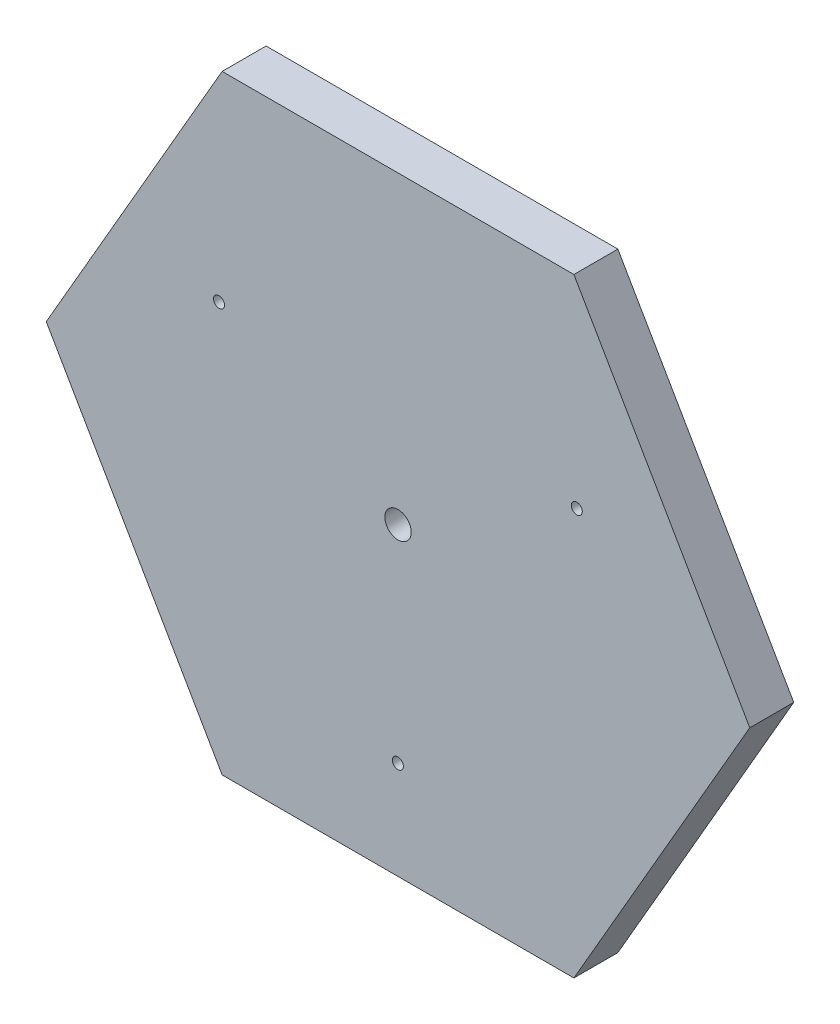
ISO-10303-21;
HEADER;
FILE_DESCRIPTION(('STEP AP214'),'2;1');
FILE_NAME('part.step','',(''),(''),'','','');
FILE_SCHEMA(('AUTOMOTIVE_DESIGN { 1 0 10303 214 1 1 1 1 }'));
ENDSEC;
DATA;
#1=APPLICATION_CONTEXT('core data for automotive mechanical design processes');
#2=APPLICATION_PROTOCOL_DEFINITION('international standard','automotive_design',2000,#1);
#3=PRODUCT_CONTEXT('',#1,'mechanical');
#4=PRODUCT('Part','Part','',(#3));
#5=PRODUCT_RELATED_PRODUCT_CATEGORY('part','',(#4));
#6=PRODUCT_DEFINITION_FORMATION('','',#4);
#7=PRODUCT_DEFINITION_CONTEXT('part definition',#1,'design');
#8=PRODUCT_DEFINITION('design','',#6,#7);
#9=PRODUCT_DEFINITION_SHAPE('','',#8);
#10=(LENGTH_UNIT() NAMED_UNIT(*) SI_UNIT(.MILLI.,.METRE.));
#11=(NAMED_UNIT(*) PLANE_ANGLE_UNIT() SI_UNIT($,.RADIAN.));
#12=(NAMED_UNIT(*) SI_UNIT($,.STERADIAN.) SOLID_ANGLE_UNIT());
#13=UNCERTAINTY_MEASURE_WITH_UNIT(LENGTH_MEASURE(1.E-05),#10,'distance_accuracy_value','');
#14=(GEOMETRIC_REPRESENTATION_CONTEXT(3) GLOBAL_UNCERTAINTY_ASSIGNED_CONTEXT((#13)) GLOBAL_UNIT_ASSIGNED_CONTEXT((#10,
#11,#12)) REPRESENTATION_CONTEXT('',''));
#15=CARTESIAN_POINT('',(0.,0.,0.));
#16=DIRECTION('',(0.,0.,1.));
#17=DIRECTION('',(1.,0.,0.));
#18=AXIS2_PLACEMENT_3D('',#15,#16,#17);
#19=CARTESIAN_POINT('',(0.,0.,10.));
#20=DIRECTION('',(0.,0.,1.));
#21=DIRECTION('',(1.,0.,0.));
#22=AXIS2_PLACEMENT_3D('',#19,#20,#21);
#23=PLANE('',#22);
#24=CARTESIAN_POINT('',(105.194995266538,79.7661246229569,10.));
#25=DIRECTION('',(0.,0.,1.));
#26=DIRECTION('',(1.,0.,0.));
#27=AXIS2_PLACEMENT_3D('',#24,#25,#26);
#28=CIRCLE('',#27,1.25);
#29=CARTESIAN_POINT('',(106.444995266538,79.7661246229569,10.));
#30=VERTEX_POINT('',#29);
#31=EDGE_CURVE('E189',#30,#30,#28,.T.);
#32=ORIENTED_EDGE('',*,*,#31,.F.);
#33=EDGE_LOOP('',(#32));
#34=FACE_BOUND('',#33,.T.);
#35=CARTESIAN_POINT('',(23.8297565584667,79.759786639688,10.));
#36=DIRECTION('',(0.,0.,1.));
#37=DIRECTION('',(1.,0.,0.));
#38=AXIS2_PLACEMENT_3D('',#35,#36,#37);
#39=CIRCLE('',#38,1.25);
#40=CARTESIAN_POINT('',(25.0797565584667,79.759786639688,10.));
#41=VERTEX_POINT('',#40);
#42=EDGE_CURVE('E122',#41,#41,#39,.T.);
#43=ORIENTED_EDGE('',*,*,#42,.F.);
#44=EDGE_LOOP('',(#43));
#45=FACE_BOUND('',#44,.T.);
#46=DIRECTION('',(-1.,0.,0.));
#47=VECTOR('',#46,1.);
#48=CARTESIAN_POINT('',(104.538271299393,125.536397109811,10.));
#49=LINE('',#48,#47);
#50=CARTESIAN_POINT('',(104.538271299393,125.536397109811,10.));
#51=VERTEX_POINT('',#50);
#52=CARTESIAN_POINT('',(24.5382712993934,125.536397109812,10.));
#53=VERTEX_POINT('',#52);
#54=EDGE_CURVE('E129',#51,#53,#49,.T.);
#55=ORIENTED_EDGE('',*,*,#54,.T.);
#56=DIRECTION('',(-0.500000000000001,-0.866025403784438,0.));
#57=VECTOR('',#56,1.);
#58=CARTESIAN_POINT('',(24.5382712993934,125.536397109812,10.));
#59=LINE('',#58,#57);
#60=CARTESIAN_POINT('',(-15.4617287006068,56.2543648070565,10.));
#61=VERTEX_POINT('',#60);
#62=EDGE_CURVE('E87',#53,#61,#59,.T.);
#63=ORIENTED_EDGE('',*,*,#62,.T.);
#64=DIRECTION('',(0.499999999999999,-0.866025403784439,0.));
#65=VECTOR('',#64,1.);
#66=CARTESIAN_POINT('',(-15.4617287006068,56.2543648070565,10.));
#67=LINE('',#66,#65);
#68=CARTESIAN_POINT('',(24.5382712993931,-13.0276674956986,10.));
#69=VERTEX_POINT('',#68);
#70=EDGE_CURVE('E100',#61,#69,#67,.T.);
#71=ORIENTED_EDGE('',*,*,#70,.T.);
#72=DIRECTION('',(1.,0.,0.));
#73=VECTOR('',#72,1.);
#74=CARTESIAN_POINT('',(24.5382712993931,-13.0276674956986,10.));
#75=LINE('',#74,#73);
#76=CARTESIAN_POINT('',(104.538271299393,-13.0276674956987,10.));
#77=VERTEX_POINT('',#76);
#78=EDGE_CURVE('E94',#69,#77,#75,.T.);
#79=ORIENTED_EDGE('',*,*,#78,.T.);
#80=DIRECTION('',(0.500000000000001,0.866025403784438,0.));
#81=VECTOR('',#80,1.);
#82=CARTESIAN_POINT('',(104.538271299393,-13.0276674956987,10.));
#83=LINE('',#82,#81);
#84=CARTESIAN_POINT('',(144.538271299393,56.2543648070564,10.));
#85=VERTEX_POINT('',#84);
#86=EDGE_CURVE('E98',#77,#85,#83,.T.);
#87=ORIENTED_EDGE('',*,*,#86,.T.);
#88=DIRECTION('',(-0.499999999999999,0.866025403784439,0.));
#89=VECTOR('',#88,1.);
#90=CARTESIAN_POINT('',(144.538271299393,56.2543648070564,10.));
#91=LINE('',#90,#89);
#92=EDGE_CURVE('E50',#85,#51,#91,.T.);
#93=ORIENTED_EDGE('',*,*,#92,.T.);
#94=EDGE_LOOP('',(#55,#63,#71,#79,#87,#93));
#95=FACE_BOUND('',#94,.T.);
#96=CARTESIAN_POINT('',(64.5,9.25443622821498,10.));
#97=DIRECTION('',(0.,0.,1.));
#98=DIRECTION('',(1.,0.,0.));
#99=AXIS2_PLACEMENT_3D('',#96,#97,#98);
#100=CIRCLE('',#99,1.25);
#101=CARTESIAN_POINT('',(65.75,9.25443622821498,10.));
#102=VERTEX_POINT('',#101);
#103=EDGE_CURVE('E195',#102,#102,#100,.T.);
#104=ORIENTED_EDGE('',*,*,#103,.F.);
#105=EDGE_LOOP('',(#104));
#106=FACE_BOUND('',#105,.T.);
#107=CARTESIAN_POINT('',(64.5382712993932,56.2543648070565,10.));
#108=DIRECTION('',(0.,0.,1.));
#109=DIRECTION('',(1.,0.,0.));
#110=AXIS2_PLACEMENT_3D('',#107,#108,#109);
#111=CIRCLE('',#110,3.);
#112=CARTESIAN_POINT('',(67.5382712993932,56.2543648070565,10.));
#113=VERTEX_POINT('',#112);
#114=EDGE_CURVE('E180',#113,#113,#111,.T.);
#115=ORIENTED_EDGE('',*,*,#114,.F.);
#116=EDGE_LOOP('',(#115));
#117=FACE_BOUND('',#116,.T.);
#118=ADVANCED_FACE('F33',(#34,#45,#95,#106,#117),#23,.T.);
#119=CARTESIAN_POINT('',(0.,0.,0.));
#120=DIRECTION('',(0.,0.,1.));
#121=DIRECTION('',(1.,0.,0.));
#122=AXIS2_PLACEMENT_3D('',#119,#120,#121);
#123=PLANE('',#122);
#124=DIRECTION('',(-1.,0.,0.));
#125=VECTOR('',#124,1.);
#126=CARTESIAN_POINT('',(104.538271299393,125.536397109811,0.));
#127=LINE('',#126,#125);
#128=CARTESIAN_POINT('',(104.538271299393,125.536397109811,0.));
#129=VERTEX_POINT('',#128);
#130=CARTESIAN_POINT('',(24.5382712993934,125.536397109812,0.));
#131=VERTEX_POINT('',#130);
#132=EDGE_CURVE('E118',#129,#131,#127,.T.);
#133=ORIENTED_EDGE('',*,*,#132,.F.);
#134=DIRECTION('',(-0.499999999999999,0.866025403784439,0.));
#135=VECTOR('',#134,1.);
#136=CARTESIAN_POINT('',(144.538271299393,56.2543648070564,0.));
#137=LINE('',#136,#135);
#138=CARTESIAN_POINT('',(144.538271299393,56.2543648070564,0.));
#139=VERTEX_POINT('',#138);
#140=EDGE_CURVE('E79',#139,#129,#137,.T.);
#141=ORIENTED_EDGE('',*,*,#140,.F.);
#142=DIRECTION('',(0.500000000000001,0.866025403784438,0.));
#143=VECTOR('',#142,1.);
#144=CARTESIAN_POINT('',(104.538271299393,-13.0276674956987,0.));
#145=LINE('',#144,#143);
#146=CARTESIAN_POINT('',(104.538271299393,-13.0276674956987,0.));
#147=VERTEX_POINT('',#146);
#148=EDGE_CURVE('E73',#147,#139,#145,.T.);
#149=ORIENTED_EDGE('',*,*,#148,.F.);
#150=DIRECTION('',(1.,0.,0.));
#151=VECTOR('',#150,1.);
#152=CARTESIAN_POINT('',(24.5382712993931,-13.0276674956986,0.));
#153=LINE('',#152,#151);
#154=CARTESIAN_POINT('',(24.5382712993931,-13.0276674956986,0.));
#155=VERTEX_POINT('',#154);
#156=EDGE_CURVE('E108',#155,#147,#153,.T.);
#157=ORIENTED_EDGE('',*,*,#156,.F.);
#158=DIRECTION('',(0.499999999999999,-0.866025403784439,0.));
#159=VECTOR('',#158,1.);
#160=CARTESIAN_POINT('',(-15.4617287006068,56.2543648070565,0.));
#161=LINE('',#160,#159);
#162=CARTESIAN_POINT('',(-15.4617287006068,56.2543648070565,0.));
#163=VERTEX_POINT('',#162);
#164=EDGE_CURVE('E124',#163,#155,#161,.T.);
#165=ORIENTED_EDGE('',*,*,#164,.F.);
#166=DIRECTION('',(-0.500000000000001,-0.866025403784438,0.));
#167=VECTOR('',#166,1.);
#168=CARTESIAN_POINT('',(24.5382712993934,125.536397109812,0.));
#169=LINE('',#168,#167);
#170=EDGE_CURVE('E121',#131,#163,#169,.T.);
#171=ORIENTED_EDGE('',*,*,#170,.F.);
#172=EDGE_LOOP('',(#133,#141,#149,#157,#165,#171));
#173=FACE_BOUND('',#172,.T.);
#174=CARTESIAN_POINT('',(23.8297565584667,79.759786639688,0.));
#175=DIRECTION('',(0.,0.,1.));
#176=DIRECTION('',(1.,0.,0.));
#177=AXIS2_PLACEMENT_3D('',#174,#175,#176);
#178=CIRCLE('',#177,1.25);
#179=CARTESIAN_POINT('',(25.0797565584667,79.759786639688,0.));
#180=VERTEX_POINT('',#179);
#181=EDGE_CURVE('E198',#180,#180,#178,.T.);
#182=ORIENTED_EDGE('',*,*,#181,.T.);
#183=EDGE_LOOP('',(#182));
#184=FACE_BOUND('',#183,.T.);
#185=CARTESIAN_POINT('',(64.5,9.25443622821498,0.));
#186=DIRECTION('',(0.,0.,1.));
#187=DIRECTION('',(1.,0.,0.));
#188=AXIS2_PLACEMENT_3D('',#185,#186,#187);
#189=CIRCLE('',#188,1.25);
#190=CARTESIAN_POINT('',(65.75,9.25443622821498,0.));
#191=VERTEX_POINT('',#190);
#192=EDGE_CURVE('E192',#191,#191,#189,.T.);
#193=ORIENTED_EDGE('',*,*,#192,.T.);
#194=EDGE_LOOP('',(#193));
#195=FACE_BOUND('',#194,.T.);
#196=CARTESIAN_POINT('',(105.194995266538,79.7661246229569,0.));
#197=DIRECTION('',(0.,0.,1.));
#198=DIRECTION('',(1.,0.,0.));
#199=AXIS2_PLACEMENT_3D('',#196,#197,#198);
#200=CIRCLE('',#199,1.25);
#201=CARTESIAN_POINT('',(106.444995266538,79.7661246229569,0.));
#202=VERTEX_POINT('',#201);
#203=EDGE_CURVE('E186',#202,#202,#200,.T.);
#204=ORIENTED_EDGE('',*,*,#203,.T.);
#205=EDGE_LOOP('',(#204));
#206=FACE_BOUND('',#205,.T.);
#207=CARTESIAN_POINT('',(64.5382712993932,56.2543648070565,0.));
#208=DIRECTION('',(0.,0.,1.));
#209=DIRECTION('',(1.,0.,0.));
#210=AXIS2_PLACEMENT_3D('',#207,#208,#209);
#211=CIRCLE('',#210,3.);
#212=CARTESIAN_POINT('',(67.5382712993932,56.2543648070565,0.));
#213=VERTEX_POINT('',#212);
#214=EDGE_CURVE('E183',#213,#213,#211,.T.);
#215=ORIENTED_EDGE('',*,*,#214,.T.);
#216=EDGE_LOOP('',(#215));
#217=FACE_BOUND('',#216,.T.);
#218=ADVANCED_FACE('F138',(#173,#184,#195,#206,#217),#123,.F.);
#219=CARTESIAN_POINT('',(104.538271299393,125.536397109811,10.));
#220=DIRECTION('',(0.,-1.,0.));
#221=DIRECTION('',(1.,0.,0.));
#222=AXIS2_PLACEMENT_3D('',#219,#220,#221);
#223=PLANE('',#222);
#224=ORIENTED_EDGE('',*,*,#132,.T.);
#225=DIRECTION('',(0.,0.,-1.));
#226=VECTOR('',#225,1.);
#227=CARTESIAN_POINT('',(24.5382712993934,125.536397109812,10.));
#228=LINE('',#227,#226);
#229=EDGE_CURVE('E11',#53,#131,#228,.T.);
#230=ORIENTED_EDGE('',*,*,#229,.F.);
#231=ORIENTED_EDGE('',*,*,#54,.F.);
#232=DIRECTION('',(0.,0.,-1.));
#233=VECTOR('',#232,1.);
#234=CARTESIAN_POINT('',(104.538271299393,125.536397109811,10.));
#235=LINE('',#234,#233);
#236=EDGE_CURVE('E114',#51,#129,#235,.T.);
#237=ORIENTED_EDGE('',*,*,#236,.T.);
#238=EDGE_LOOP('',(#224,#230,#231,#237));
#239=FACE_BOUND('',#238,.T.);
#240=ADVANCED_FACE('F35',(#239),#223,.F.);
#241=CARTESIAN_POINT('',(24.5382712993934,125.536397109812,10.));
#242=DIRECTION('',(0.866025403784438,-0.500000000000001,0.));
#243=DIRECTION('',(0.500000000000001,0.866025403784438,0.));
#244=AXIS2_PLACEMENT_3D('',#241,#242,#243);
#245=PLANE('',#244);
#246=ORIENTED_EDGE('',*,*,#170,.T.);
#247=DIRECTION('',(0.,0.,-1.));
#248=VECTOR('',#247,1.);
#249=CARTESIAN_POINT('',(-15.4617287006068,56.2543648070565,10.));
#250=LINE('',#249,#248);
#251=EDGE_CURVE('E42',#61,#163,#250,.T.);
#252=ORIENTED_EDGE('',*,*,#251,.F.);
#253=ORIENTED_EDGE('',*,*,#62,.F.);
#254=ORIENTED_EDGE('',*,*,#229,.T.);
#255=EDGE_LOOP('',(#246,#252,#253,#254));
#256=FACE_BOUND('',#255,.T.);
#257=ADVANCED_FACE('F256',(#256),#245,.F.);
#258=CARTESIAN_POINT('',(-15.4617287006068,56.2543648070565,10.));
#259=DIRECTION('',(0.866025403784439,0.499999999999999,0.));
#260=DIRECTION('',(-0.499999999999999,0.866025403784439,0.));
#261=AXIS2_PLACEMENT_3D('',#258,#259,#260);
#262=PLANE('',#261);
#263=ORIENTED_EDGE('',*,*,#164,.T.);
#264=DIRECTION('',(0.,0.,-1.));
#265=VECTOR('',#264,1.);
#266=CARTESIAN_POINT('',(24.5382712993931,-13.0276674956986,10.));
#267=LINE('',#266,#265);
#268=EDGE_CURVE('E109',#69,#155,#267,.T.);
#269=ORIENTED_EDGE('',*,*,#268,.F.);
#270=ORIENTED_EDGE('',*,*,#70,.F.);
#271=ORIENTED_EDGE('',*,*,#251,.T.);
#272=EDGE_LOOP('',(#263,#269,#270,#271));
#273=FACE_BOUND('',#272,.T.);
#274=ADVANCED_FACE('F135',(#273),#262,.F.);
#275=CARTESIAN_POINT('',(24.5382712993931,-13.0276674956986,10.));
#276=DIRECTION('',(0.,1.,0.));
#277=DIRECTION('',(-1.,0.,0.));
#278=AXIS2_PLACEMENT_3D('',#275,#276,#277);
#279=PLANE('',#278);
#280=ORIENTED_EDGE('',*,*,#156,.T.);
#281=DIRECTION('',(0.,0.,-1.));
#282=VECTOR('',#281,1.);
#283=CARTESIAN_POINT('',(104.538271299393,-13.0276674956987,10.));
#284=LINE('',#283,#282);
#285=EDGE_CURVE('E105',#77,#147,#284,.T.);
#286=ORIENTED_EDGE('',*,*,#285,.F.);
#287=ORIENTED_EDGE('',*,*,#78,.F.);
#288=ORIENTED_EDGE('',*,*,#268,.T.);
#289=EDGE_LOOP('',(#280,#286,#287,#288));
#290=FACE_BOUND('',#289,.T.);
#291=ADVANCED_FACE('F106',(#290),#279,.F.);
#292=CARTESIAN_POINT('',(104.538271299393,-13.0276674956987,10.));
#293=DIRECTION('',(-0.866025403784438,0.500000000000001,0.));
#294=DIRECTION('',(-0.500000000000001,-0.866025403784438,0.));
#295=AXIS2_PLACEMENT_3D('',#292,#293,#294);
#296=PLANE('',#295);
#297=ORIENTED_EDGE('',*,*,#148,.T.);
#298=DIRECTION('',(0.,0.,-1.));
#299=VECTOR('',#298,1.);
#300=CARTESIAN_POINT('',(144.538271299393,56.2543648070564,10.));
#301=LINE('',#300,#299);
#302=EDGE_CURVE('E110',#85,#139,#301,.T.);
#303=ORIENTED_EDGE('',*,*,#302,.F.);
#304=ORIENTED_EDGE('',*,*,#86,.F.);
#305=ORIENTED_EDGE('',*,*,#285,.T.);
#306=EDGE_LOOP('',(#297,#303,#304,#305));
#307=FACE_BOUND('',#306,.T.);
#308=ADVANCED_FACE('F112',(#307),#296,.F.);
#309=CARTESIAN_POINT('',(144.538271299393,56.2543648070564,10.));
#310=DIRECTION('',(-0.866025403784439,-0.499999999999999,0.));
#311=DIRECTION('',(0.499999999999999,-0.866025403784439,0.));
#312=AXIS2_PLACEMENT_3D('',#309,#310,#311);
#313=PLANE('',#312);
#314=ORIENTED_EDGE('',*,*,#140,.T.);
#315=ORIENTED_EDGE('',*,*,#236,.F.);
#316=ORIENTED_EDGE('',*,*,#92,.F.);
#317=ORIENTED_EDGE('',*,*,#302,.T.);
#318=EDGE_LOOP('',(#314,#315,#316,#317));
#319=FACE_BOUND('',#318,.T.);
#320=ADVANCED_FACE('F143',(#319),#313,.F.);
#321=CARTESIAN_POINT('',(23.8297565584667,79.759786639688,10.));
#322=DIRECTION('',(0.,0.,-1.));
#323=DIRECTION('',(-1.,0.,0.));
#324=AXIS2_PLACEMENT_3D('',#321,#322,#323);
#325=CYLINDRICAL_SURFACE('',#324,1.25);
#326=ORIENTED_EDGE('',*,*,#42,.T.);
#327=EDGE_LOOP('',(#326));
#328=FACE_BOUND('',#327,.T.);
#329=ORIENTED_EDGE('',*,*,#181,.F.);
#330=EDGE_LOOP('',(#329));
#331=FACE_BOUND('',#330,.T.);
#332=ADVANCED_FACE('F145',(#328,#331),#325,.F.);
#333=CARTESIAN_POINT('',(64.5,9.25443622821498,10.));
#334=DIRECTION('',(0.,0.,-1.));
#335=DIRECTION('',(-1.,0.,0.));
#336=AXIS2_PLACEMENT_3D('',#333,#334,#335);
#337=CYLINDRICAL_SURFACE('',#336,1.25);
#338=ORIENTED_EDGE('',*,*,#103,.T.);
#339=EDGE_LOOP('',(#338));
#340=FACE_BOUND('',#339,.T.);
#341=ORIENTED_EDGE('',*,*,#192,.F.);
#342=EDGE_LOOP('',(#341));
#343=FACE_BOUND('',#342,.T.);
#344=ADVANCED_FACE('F151',(#340,#343),#337,.F.);
#345=CARTESIAN_POINT('',(105.194995266538,79.7661246229569,10.));
#346=DIRECTION('',(0.,0.,-1.));
#347=DIRECTION('',(-1.,0.,0.));
#348=AXIS2_PLACEMENT_3D('',#345,#346,#347);
#349=CYLINDRICAL_SURFACE('',#348,1.25);
#350=ORIENTED_EDGE('',*,*,#31,.T.);
#351=EDGE_LOOP('',(#350));
#352=FACE_BOUND('',#351,.T.);
#353=ORIENTED_EDGE('',*,*,#203,.F.);
#354=EDGE_LOOP('',(#353));
#355=FACE_BOUND('',#354,.T.);
#356=ADVANCED_FACE('F167',(#352,#355),#349,.F.);
#357=CARTESIAN_POINT('',(64.5382712993932,56.2543648070565,10.));
#358=DIRECTION('',(0.,0.,-1.));
#359=DIRECTION('',(-1.,0.,0.));
#360=AXIS2_PLACEMENT_3D('',#357,#358,#359);
#361=CYLINDRICAL_SURFACE('',#360,3.);
#362=ORIENTED_EDGE('',*,*,#114,.T.);
#363=EDGE_LOOP('',(#362));
#364=FACE_BOUND('',#363,.T.);
#365=ORIENTED_EDGE('',*,*,#214,.F.);
#366=EDGE_LOOP('',(#365));
#367=FACE_BOUND('',#366,.T.);
#368=ADVANCED_FACE('F171',(#364,#367),#361,.F.);
#369=CLOSED_SHELL('',(#118,#218,#240,#257,#274,#291,#308,#320,#332,#344,#356,#368));
#370=MANIFOLD_SOLID_BREP('B2',#369);
#371=ADVANCED_BREP_SHAPE_REPRESENTATION('',(#18,#370),#14);
#372=SHAPE_DEFINITION_REPRESENTATION(#9,#371);
ENDSEC;
END-ISO-10303-21;
